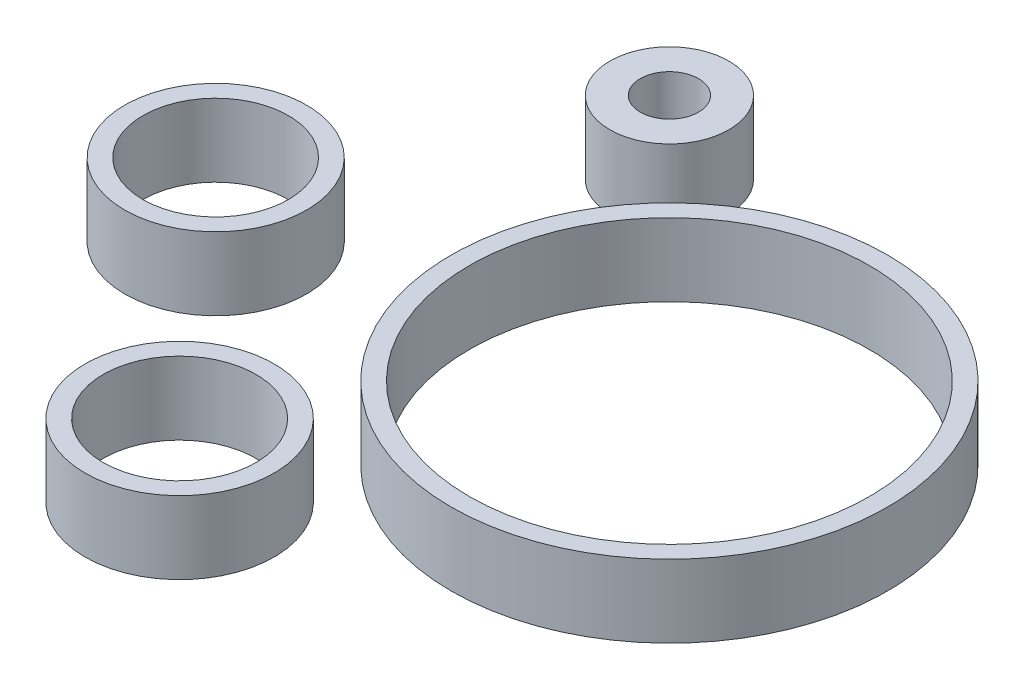
ISO-10303-21;
HEADER;
FILE_DESCRIPTION(('STEP AP214'),'2;1');
FILE_NAME('part.step','',(''),(''),'','','');
FILE_SCHEMA(('AUTOMOTIVE_DESIGN { 1 0 10303 214 1 1 1 1 }'));
ENDSEC;
DATA;
#1=APPLICATION_CONTEXT('core data for automotive mechanical design processes');
#2=APPLICATION_PROTOCOL_DEFINITION('international standard','automotive_design',2000,#1);
#3=PRODUCT_CONTEXT('',#1,'mechanical');
#4=PRODUCT('Part','Part','',(#3));
#5=PRODUCT_RELATED_PRODUCT_CATEGORY('part','',(#4));
#6=PRODUCT_DEFINITION_FORMATION('','',#4);
#7=PRODUCT_DEFINITION_CONTEXT('part definition',#1,'design');
#8=PRODUCT_DEFINITION('design','',#6,#7);
#9=PRODUCT_DEFINITION_SHAPE('','',#8);
#10=(LENGTH_UNIT() NAMED_UNIT(*) SI_UNIT(.MILLI.,.METRE.));
#11=(NAMED_UNIT(*) PLANE_ANGLE_UNIT() SI_UNIT($,.RADIAN.));
#12=(NAMED_UNIT(*) SI_UNIT($,.STERADIAN.) SOLID_ANGLE_UNIT());
#13=UNCERTAINTY_MEASURE_WITH_UNIT(LENGTH_MEASURE(1.E-05),#10,'distance_accuracy_value','');
#14=(GEOMETRIC_REPRESENTATION_CONTEXT(3) GLOBAL_UNCERTAINTY_ASSIGNED_CONTEXT((#13)) GLOBAL_UNIT_ASSIGNED_CONTEXT((#10,
#11,#12)) REPRESENTATION_CONTEXT('',''));
#15=CARTESIAN_POINT('',(0.,0.,0.));
#16=DIRECTION('',(0.,0.,1.));
#17=DIRECTION('',(1.,0.,0.));
#18=AXIS2_PLACEMENT_3D('',#15,#16,#17);
#19=CARTESIAN_POINT('',(-29.98423137173,5.,-6.69079118767807));
#20=DIRECTION('',(0.,1.,0.));
#21=DIRECTION('',(0.,0.,1.));
#22=AXIS2_PLACEMENT_3D('',#19,#20,#21);
#23=PLANE('',#22);
#24=CARTESIAN_POINT('',(-29.98423137173,5.,-6.69079118767807));
#25=DIRECTION('',(0.,1.,0.));
#26=DIRECTION('',(0.,0.,1.));
#27=AXIS2_PLACEMENT_3D('',#24,#25,#26);
#28=CIRCLE('',#27,4.09124722954816);
#29=CARTESIAN_POINT('',(-29.98423137173,5.,-2.5995439581299));
#30=VERTEX_POINT('',#29);
#31=EDGE_CURVE('E11',#30,#30,#28,.T.);
#32=ORIENTED_EDGE('',*,*,#31,.T.);
#33=EDGE_LOOP('',(#32));
#34=FACE_BOUND('',#33,.T.);
#35=CARTESIAN_POINT('',(-29.98423137173,5.,-6.69079118767807));
#36=DIRECTION('',(0.,1.,0.));
#37=DIRECTION('',(0.,0.,1.));
#38=AXIS2_PLACEMENT_3D('',#35,#36,#37);
#39=CIRCLE('',#38,2.);
#40=CARTESIAN_POINT('',(-29.98423137173,5.,-4.69079118767806));
#41=VERTEX_POINT('',#40);
#42=EDGE_CURVE('E53',#41,#41,#39,.T.);
#43=ORIENTED_EDGE('',*,*,#42,.F.);
#44=EDGE_LOOP('',(#43));
#45=FACE_BOUND('',#44,.T.);
#46=ADVANCED_FACE('F42',(#34,#45),#23,.T.);
#47=CARTESIAN_POINT('',(-29.98423137173,0.,-6.69079118767807));
#48=DIRECTION('',(0.,1.,0.));
#49=DIRECTION('',(0.,0.,1.));
#50=AXIS2_PLACEMENT_3D('',#47,#48,#49);
#51=PLANE('',#50);
#52=CARTESIAN_POINT('',(-29.98423137173,0.,-6.69079118767807));
#53=DIRECTION('',(0.,1.,0.));
#54=DIRECTION('',(0.,0.,1.));
#55=AXIS2_PLACEMENT_3D('',#52,#53,#54);
#56=CIRCLE('',#55,4.09124722954816);
#57=CARTESIAN_POINT('',(-29.98423137173,0.,-2.5995439581299));
#58=VERTEX_POINT('',#57);
#59=EDGE_CURVE('E46',#58,#58,#56,.T.);
#60=ORIENTED_EDGE('',*,*,#59,.F.);
#61=EDGE_LOOP('',(#60));
#62=FACE_BOUND('',#61,.T.);
#63=CARTESIAN_POINT('',(-29.98423137173,0.,-6.69079118767807));
#64=DIRECTION('',(0.,1.,0.));
#65=DIRECTION('',(0.,0.,1.));
#66=AXIS2_PLACEMENT_3D('',#63,#64,#65);
#67=CIRCLE('',#66,2.);
#68=CARTESIAN_POINT('',(-29.98423137173,0.,-4.69079118767806));
#69=VERTEX_POINT('',#68);
#70=EDGE_CURVE('E55',#69,#69,#67,.T.);
#71=ORIENTED_EDGE('',*,*,#70,.T.);
#72=EDGE_LOOP('',(#71));
#73=FACE_BOUND('',#72,.T.);
#74=ADVANCED_FACE('F65',(#62,#73),#51,.F.);
#75=CARTESIAN_POINT('',(-29.98423137173,5.,-6.69079118767807));
#76=DIRECTION('',(0.,-1.,0.));
#77=DIRECTION('',(0.,0.,-1.));
#78=AXIS2_PLACEMENT_3D('',#75,#76,#77);
#79=CYLINDRICAL_SURFACE('',#78,4.09124722954816);
#80=ORIENTED_EDGE('',*,*,#31,.F.);
#81=EDGE_LOOP('',(#80));
#82=FACE_BOUND('',#81,.T.);
#83=ORIENTED_EDGE('',*,*,#59,.T.);
#84=EDGE_LOOP('',(#83));
#85=FACE_BOUND('',#84,.T.);
#86=ADVANCED_FACE('F44',(#82,#85),#79,.T.);
#87=CARTESIAN_POINT('',(-29.98423137173,5.,-6.69079118767807));
#88=DIRECTION('',(0.,-1.,0.));
#89=DIRECTION('',(0.,0.,-1.));
#90=AXIS2_PLACEMENT_3D('',#87,#88,#89);
#91=CYLINDRICAL_SURFACE('',#90,2.);
#92=ORIENTED_EDGE('',*,*,#42,.T.);
#93=EDGE_LOOP('',(#92));
#94=FACE_BOUND('',#93,.T.);
#95=ORIENTED_EDGE('',*,*,#70,.F.);
#96=EDGE_LOOP('',(#95));
#97=FACE_BOUND('',#96,.T.);
#98=ADVANCED_FACE('F61',(#94,#97),#91,.F.);
#99=CLOSED_SHELL('',(#46,#74,#86,#98));
#100=MANIFOLD_SOLID_BREP('B2',#99);
#101=CARTESIAN_POINT('',(-27.5851951049226,5.,29.3676222155597));
#102=DIRECTION('',(0.,1.,0.));
#103=DIRECTION('',(0.,0.,1.));
#104=AXIS2_PLACEMENT_3D('',#101,#102,#103);
#105=PLANE('',#104);
#106=CARTESIAN_POINT('',(-27.5851951049226,5.,29.3676222155597));
#107=DIRECTION('',(0.,1.,0.));
#108=DIRECTION('',(0.,0.,1.));
#109=AXIS2_PLACEMENT_3D('',#106,#107,#108);
#110=CIRCLE('',#109,6.5);
#111=CARTESIAN_POINT('',(-27.5851951049226,5.,35.8676222155597));
#112=VERTEX_POINT('',#111);
#113=EDGE_CURVE('E41',#112,#112,#110,.T.);
#114=ORIENTED_EDGE('',*,*,#113,.T.);
#115=EDGE_LOOP('',(#114));
#116=FACE_BOUND('',#115,.T.);
#117=CARTESIAN_POINT('',(-27.5851951049226,5.,29.3676222155597));
#118=DIRECTION('',(0.,1.,0.));
#119=DIRECTION('',(0.,0.,1.));
#120=AXIS2_PLACEMENT_3D('',#117,#118,#119);
#121=CIRCLE('',#120,5.25);
#122=CARTESIAN_POINT('',(-27.5851951049226,5.,34.6176222155597));
#123=VERTEX_POINT('',#122);
#124=EDGE_CURVE('E123',#123,#123,#121,.T.);
#125=ORIENTED_EDGE('',*,*,#124,.F.);
#126=EDGE_LOOP('',(#125));
#127=FACE_BOUND('',#126,.T.);
#128=ADVANCED_FACE('F112',(#116,#127),#105,.T.);
#129=CARTESIAN_POINT('',(-27.5851951049226,0.,29.3676222155597));
#130=DIRECTION('',(0.,1.,0.));
#131=DIRECTION('',(0.,0.,1.));
#132=AXIS2_PLACEMENT_3D('',#129,#130,#131);
#133=PLANE('',#132);
#134=CARTESIAN_POINT('',(-27.5851951049226,0.,29.3676222155597));
#135=DIRECTION('',(0.,1.,0.));
#136=DIRECTION('',(0.,0.,1.));
#137=AXIS2_PLACEMENT_3D('',#134,#135,#136);
#138=CIRCLE('',#137,6.5);
#139=CARTESIAN_POINT('',(-27.5851951049226,0.,35.8676222155597));
#140=VERTEX_POINT('',#139);
#141=EDGE_CURVE('E116',#140,#140,#138,.T.);
#142=ORIENTED_EDGE('',*,*,#141,.F.);
#143=EDGE_LOOP('',(#142));
#144=FACE_BOUND('',#143,.T.);
#145=CARTESIAN_POINT('',(-27.5851951049226,0.,29.3676222155597));
#146=DIRECTION('',(0.,1.,0.));
#147=DIRECTION('',(0.,0.,1.));
#148=AXIS2_PLACEMENT_3D('',#145,#146,#147);
#149=CIRCLE('',#148,5.25);
#150=CARTESIAN_POINT('',(-27.5851951049226,0.,34.6176222155597));
#151=VERTEX_POINT('',#150);
#152=EDGE_CURVE('E125',#151,#151,#149,.T.);
#153=ORIENTED_EDGE('',*,*,#152,.T.);
#154=EDGE_LOOP('',(#153));
#155=FACE_BOUND('',#154,.T.);
#156=ADVANCED_FACE('F135',(#144,#155),#133,.F.);
#157=CARTESIAN_POINT('',(-27.5851951049226,5.,29.3676222155597));
#158=DIRECTION('',(0.,-1.,0.));
#159=DIRECTION('',(0.,0.,-1.));
#160=AXIS2_PLACEMENT_3D('',#157,#158,#159);
#161=CYLINDRICAL_SURFACE('',#160,6.5);
#162=ORIENTED_EDGE('',*,*,#113,.F.);
#163=EDGE_LOOP('',(#162));
#164=FACE_BOUND('',#163,.T.);
#165=ORIENTED_EDGE('',*,*,#141,.T.);
#166=EDGE_LOOP('',(#165));
#167=FACE_BOUND('',#166,.T.);
#168=ADVANCED_FACE('F114',(#164,#167),#161,.T.);
#169=CARTESIAN_POINT('',(-27.5851951049226,5.,29.3676222155597));
#170=DIRECTION('',(0.,-1.,0.));
#171=DIRECTION('',(0.,0.,-1.));
#172=AXIS2_PLACEMENT_3D('',#169,#170,#171);
#173=CYLINDRICAL_SURFACE('',#172,5.25);
#174=ORIENTED_EDGE('',*,*,#124,.T.);
#175=EDGE_LOOP('',(#174));
#176=FACE_BOUND('',#175,.T.);
#177=ORIENTED_EDGE('',*,*,#152,.F.);
#178=EDGE_LOOP('',(#177));
#179=FACE_BOUND('',#178,.T.);
#180=ADVANCED_FACE('F131',(#176,#179),#173,.F.);
#181=CLOSED_SHELL('',(#128,#156,#168,#180));
#182=MANIFOLD_SOLID_BREP('B6',#181);
#183=CARTESIAN_POINT('',(-41.8744218915066,5.,12.6009413923995));
#184=DIRECTION('',(0.,1.,0.));
#185=DIRECTION('',(0.,0.,1.));
#186=AXIS2_PLACEMENT_3D('',#183,#184,#185);
#187=PLANE('',#186);
#188=CARTESIAN_POINT('',(-41.8744218915066,5.,12.6009413923995));
#189=DIRECTION('',(0.,1.,0.));
#190=DIRECTION('',(0.,0.,1.));
#191=AXIS2_PLACEMENT_3D('',#188,#189,#190);
#192=CIRCLE('',#191,6.25);
#193=CARTESIAN_POINT('',(-41.8744218915066,5.,18.8509413923995));
#194=VERTEX_POINT('',#193);
#195=EDGE_CURVE('E111',#194,#194,#192,.T.);
#196=ORIENTED_EDGE('',*,*,#195,.T.);
#197=EDGE_LOOP('',(#196));
#198=FACE_BOUND('',#197,.T.);
#199=CARTESIAN_POINT('',(-41.8744218915066,5.,12.6009413923995));
#200=DIRECTION('',(0.,1.,0.));
#201=DIRECTION('',(0.,0.,1.));
#202=AXIS2_PLACEMENT_3D('',#199,#200,#201);
#203=CIRCLE('',#202,5.);
#204=CARTESIAN_POINT('',(-41.8744218915066,5.,17.6009413923995));
#205=VERTEX_POINT('',#204);
#206=EDGE_CURVE('E192',#205,#205,#203,.T.);
#207=ORIENTED_EDGE('',*,*,#206,.F.);
#208=EDGE_LOOP('',(#207));
#209=FACE_BOUND('',#208,.T.);
#210=ADVANCED_FACE('F181',(#198,#209),#187,.T.);
#211=CARTESIAN_POINT('',(-41.8744218915066,0.,12.6009413923995));
#212=DIRECTION('',(0.,1.,0.));
#213=DIRECTION('',(0.,0.,1.));
#214=AXIS2_PLACEMENT_3D('',#211,#212,#213);
#215=PLANE('',#214);
#216=CARTESIAN_POINT('',(-41.8744218915066,0.,12.6009413923995));
#217=DIRECTION('',(0.,1.,0.));
#218=DIRECTION('',(0.,0.,1.));
#219=AXIS2_PLACEMENT_3D('',#216,#217,#218);
#220=CIRCLE('',#219,6.25);
#221=CARTESIAN_POINT('',(-41.8744218915066,0.,18.8509413923995));
#222=VERTEX_POINT('',#221);
#223=EDGE_CURVE('E185',#222,#222,#220,.T.);
#224=ORIENTED_EDGE('',*,*,#223,.F.);
#225=EDGE_LOOP('',(#224));
#226=FACE_BOUND('',#225,.T.);
#227=CARTESIAN_POINT('',(-41.8744218915066,0.,12.6009413923995));
#228=DIRECTION('',(0.,1.,0.));
#229=DIRECTION('',(0.,0.,1.));
#230=AXIS2_PLACEMENT_3D('',#227,#228,#229);
#231=CIRCLE('',#230,5.);
#232=CARTESIAN_POINT('',(-41.8744218915066,0.,17.6009413923995));
#233=VERTEX_POINT('',#232);
#234=EDGE_CURVE('E194',#233,#233,#231,.T.);
#235=ORIENTED_EDGE('',*,*,#234,.T.);
#236=EDGE_LOOP('',(#235));
#237=FACE_BOUND('',#236,.T.);
#238=ADVANCED_FACE('F204',(#226,#237),#215,.F.);
#239=CARTESIAN_POINT('',(-41.8744218915066,5.,12.6009413923995));
#240=DIRECTION('',(0.,-1.,0.));
#241=DIRECTION('',(0.,0.,-1.));
#242=AXIS2_PLACEMENT_3D('',#239,#240,#241);
#243=CYLINDRICAL_SURFACE('',#242,6.25);
#244=ORIENTED_EDGE('',*,*,#195,.F.);
#245=EDGE_LOOP('',(#244));
#246=FACE_BOUND('',#245,.T.);
#247=ORIENTED_EDGE('',*,*,#223,.T.);
#248=EDGE_LOOP('',(#247));
#249=FACE_BOUND('',#248,.T.);
#250=ADVANCED_FACE('F183',(#246,#249),#243,.T.);
#251=CARTESIAN_POINT('',(-41.8744218915066,5.,12.6009413923995));
#252=DIRECTION('',(0.,-1.,0.));
#253=DIRECTION('',(0.,0.,-1.));
#254=AXIS2_PLACEMENT_3D('',#251,#252,#253);
#255=CYLINDRICAL_SURFACE('',#254,5.);
#256=ORIENTED_EDGE('',*,*,#206,.T.);
#257=EDGE_LOOP('',(#256));
#258=FACE_BOUND('',#257,.T.);
#259=ORIENTED_EDGE('',*,*,#234,.F.);
#260=EDGE_LOOP('',(#259));
#261=FACE_BOUND('',#260,.T.);
#262=ADVANCED_FACE('F200',(#258,#261),#255,.F.);
#263=CLOSED_SHELL('',(#210,#238,#250,#262));
#264=MANIFOLD_SOLID_BREP('B36',#263);
#265=CARTESIAN_POINT('',(-12.98423137173,5.,10.3092088123219));
#266=DIRECTION('',(0.,1.,0.));
#267=DIRECTION('',(0.,0.,1.));
#268=AXIS2_PLACEMENT_3D('',#265,#266,#267);
#269=PLANE('',#268);
#270=CARTESIAN_POINT('',(-12.98423137173,5.,10.3092088123219));
#271=DIRECTION('',(0.,1.,0.));
#272=DIRECTION('',(0.,0.,1.));
#273=AXIS2_PLACEMENT_3D('',#270,#271,#272);
#274=CIRCLE('',#273,15.);
#275=CARTESIAN_POINT('',(-12.98423137173,5.,25.3092088123219));
#276=VERTEX_POINT('',#275);
#277=EDGE_CURVE('E180',#276,#276,#274,.T.);
#278=ORIENTED_EDGE('',*,*,#277,.T.);
#279=EDGE_LOOP('',(#278));
#280=FACE_BOUND('',#279,.T.);
#281=CARTESIAN_POINT('',(-12.98423137173,5.,10.3092088123219));
#282=DIRECTION('',(0.,1.,0.));
#283=DIRECTION('',(0.,0.,1.));
#284=AXIS2_PLACEMENT_3D('',#281,#282,#283);
#285=CIRCLE('',#284,13.75);
#286=CARTESIAN_POINT('',(-12.98423137173,5.,24.0592088123219));
#287=VERTEX_POINT('',#286);
#288=EDGE_CURVE('E254',#287,#287,#285,.T.);
#289=ORIENTED_EDGE('',*,*,#288,.F.);
#290=EDGE_LOOP('',(#289));
#291=FACE_BOUND('',#290,.T.);
#292=ADVANCED_FACE('F243',(#280,#291),#269,.T.);
#293=CARTESIAN_POINT('',(-12.98423137173,0.,10.3092088123219));
#294=DIRECTION('',(0.,1.,0.));
#295=DIRECTION('',(0.,0.,1.));
#296=AXIS2_PLACEMENT_3D('',#293,#294,#295);
#297=PLANE('',#296);
#298=CARTESIAN_POINT('',(-12.98423137173,0.,10.3092088123219));
#299=DIRECTION('',(0.,1.,0.));
#300=DIRECTION('',(0.,0.,1.));
#301=AXIS2_PLACEMENT_3D('',#298,#299,#300);
#302=CIRCLE('',#301,15.);
#303=CARTESIAN_POINT('',(-12.98423137173,0.,25.3092088123219));
#304=VERTEX_POINT('',#303);
#305=EDGE_CURVE('E247',#304,#304,#302,.T.);
#306=ORIENTED_EDGE('',*,*,#305,.F.);
#307=EDGE_LOOP('',(#306));
#308=FACE_BOUND('',#307,.T.);
#309=CARTESIAN_POINT('',(-12.98423137173,0.,10.3092088123219));
#310=DIRECTION('',(0.,1.,0.));
#311=DIRECTION('',(0.,0.,1.));
#312=AXIS2_PLACEMENT_3D('',#309,#310,#311);
#313=CIRCLE('',#312,13.75);
#314=CARTESIAN_POINT('',(-12.98423137173,0.,24.0592088123219));
#315=VERTEX_POINT('',#314);
#316=EDGE_CURVE('E256',#315,#315,#313,.T.);
#317=ORIENTED_EDGE('',*,*,#316,.T.);
#318=EDGE_LOOP('',(#317));
#319=FACE_BOUND('',#318,.T.);
#320=ADVANCED_FACE('F266',(#308,#319),#297,.F.);
#321=CARTESIAN_POINT('',(-12.98423137173,5.,10.3092088123219));
#322=DIRECTION('',(0.,-1.,0.));
#323=DIRECTION('',(0.,0.,-1.));
#324=AXIS2_PLACEMENT_3D('',#321,#322,#323);
#325=CYLINDRICAL_SURFACE('',#324,15.);
#326=ORIENTED_EDGE('',*,*,#277,.F.);
#327=EDGE_LOOP('',(#326));
#328=FACE_BOUND('',#327,.T.);
#329=ORIENTED_EDGE('',*,*,#305,.T.);
#330=EDGE_LOOP('',(#329));
#331=FACE_BOUND('',#330,.T.);
#332=ADVANCED_FACE('F245',(#328,#331),#325,.T.);
#333=CARTESIAN_POINT('',(-12.98423137173,5.,10.3092088123219));
#334=DIRECTION('',(0.,-1.,0.));
#335=DIRECTION('',(0.,0.,-1.));
#336=AXIS2_PLACEMENT_3D('',#333,#334,#335);
#337=CYLINDRICAL_SURFACE('',#336,13.75);
#338=ORIENTED_EDGE('',*,*,#288,.T.);
#339=EDGE_LOOP('',(#338));
#340=FACE_BOUND('',#339,.T.);
#341=ORIENTED_EDGE('',*,*,#316,.F.);
#342=EDGE_LOOP('',(#341));
#343=FACE_BOUND('',#342,.T.);
#344=ADVANCED_FACE('F262',(#340,#343),#337,.F.);
#345=CLOSED_SHELL('',(#292,#320,#332,#344));
#346=MANIFOLD_SOLID_BREP('B106',#345);
#347=ADVANCED_BREP_SHAPE_REPRESENTATION('',(#18,#100,#182,#264,#346),#14);
#348=SHAPE_DEFINITION_REPRESENTATION(#9,#347);
ENDSEC;
END-ISO-10303-21;
